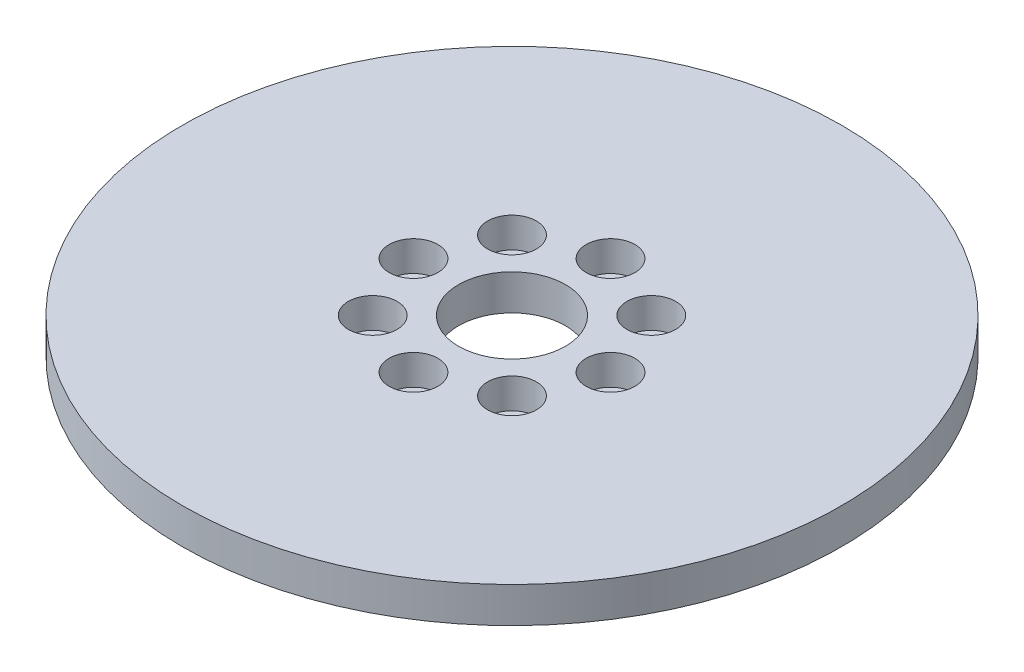
ISO-10303-21;
HEADER;
FILE_DESCRIPTION(('STEP AP214'),'2;1');
FILE_NAME('part.step','',(''),(''),'','','');
FILE_SCHEMA(('AUTOMOTIVE_DESIGN { 1 0 10303 214 1 1 1 1 }'));
ENDSEC;
DATA;
#1=APPLICATION_CONTEXT('core data for automotive mechanical design processes');
#2=APPLICATION_PROTOCOL_DEFINITION('international standard','automotive_design',2000,#1);
#3=PRODUCT_CONTEXT('',#1,'mechanical');
#4=PRODUCT('Part','Part','',(#3));
#5=PRODUCT_RELATED_PRODUCT_CATEGORY('part','',(#4));
#6=PRODUCT_DEFINITION_FORMATION('','',#4);
#7=PRODUCT_DEFINITION_CONTEXT('part definition',#1,'design');
#8=PRODUCT_DEFINITION('design','',#6,#7);
#9=PRODUCT_DEFINITION_SHAPE('','',#8);
#10=(LENGTH_UNIT() NAMED_UNIT(*) SI_UNIT(.MILLI.,.METRE.));
#11=(NAMED_UNIT(*) PLANE_ANGLE_UNIT() SI_UNIT($,.RADIAN.));
#12=(NAMED_UNIT(*) SI_UNIT($,.STERADIAN.) SOLID_ANGLE_UNIT());
#13=UNCERTAINTY_MEASURE_WITH_UNIT(LENGTH_MEASURE(1.E-05),#10,'distance_accuracy_value','');
#14=(GEOMETRIC_REPRESENTATION_CONTEXT(3) GLOBAL_UNCERTAINTY_ASSIGNED_CONTEXT((#13)) GLOBAL_UNIT_ASSIGNED_CONTEXT((#10,
#11,#12)) REPRESENTATION_CONTEXT('',''));
#15=CARTESIAN_POINT('',(0.,0.,0.));
#16=DIRECTION('',(0.,0.,1.));
#17=DIRECTION('',(1.,0.,0.));
#18=AXIS2_PLACEMENT_3D('',#15,#16,#17);
#19=CARTESIAN_POINT('',(0.,10.,0.));
#20=DIRECTION('',(0.,-1.,0.));
#21=DIRECTION('',(0.,0.,-1.));
#22=AXIS2_PLACEMENT_3D('',#19,#20,#21);
#23=CYLINDRICAL_SURFACE('',#22,92.5);
#24=CARTESIAN_POINT('',(0.,10.,0.));
#25=DIRECTION('',(0.,1.,0.));
#26=DIRECTION('',(0.,0.,1.));
#27=AXIS2_PLACEMENT_3D('',#24,#25,#26);
#28=CIRCLE('',#27,92.5);
#29=CARTESIAN_POINT('',(0.,10.,92.5));
#30=VERTEX_POINT('',#29);
#31=EDGE_CURVE('E10',#30,#30,#28,.T.);
#32=ORIENTED_EDGE('',*,*,#31,.F.);
#33=EDGE_LOOP('',(#32));
#34=FACE_BOUND('',#33,.T.);
#35=CARTESIAN_POINT('',(0.,0.,0.));
#36=DIRECTION('',(0.,1.,0.));
#37=DIRECTION('',(0.,0.,1.));
#38=AXIS2_PLACEMENT_3D('',#35,#36,#37);
#39=CIRCLE('',#38,92.5);
#40=CARTESIAN_POINT('',(0.,0.,92.5));
#41=VERTEX_POINT('',#40);
#42=EDGE_CURVE('E37',#41,#41,#39,.T.);
#43=ORIENTED_EDGE('',*,*,#42,.T.);
#44=EDGE_LOOP('',(#43));
#45=FACE_BOUND('',#44,.T.);
#46=ADVANCED_FACE('F40',(#34,#45),#23,.T.);
#47=CARTESIAN_POINT('',(0.,10.,0.));
#48=DIRECTION('',(0.,1.,0.));
#49=DIRECTION('',(0.,0.,1.));
#50=AXIS2_PLACEMENT_3D('',#47,#48,#49);
#51=PLANE('',#50);
#52=CARTESIAN_POINT('',(0.,10.,27.6490217323456));
#53=DIRECTION('',(0.,1.,0.));
#54=DIRECTION('',(1.,0.,0.));
#55=AXIS2_PLACEMENT_3D('',#52,#53,#54);
#56=CIRCLE('',#55,6.83702229934793);
#57=CARTESIAN_POINT('',(6.83702229934802,10.,27.6490217323456));
#58=VERTEX_POINT('',#57);
#59=EDGE_CURVE('E88',#58,#58,#56,.T.);
#60=ORIENTED_EDGE('',*,*,#59,.F.);
#61=EDGE_LOOP('',(#60));
#62=FACE_BOUND('',#61,.T.);
#63=CARTESIAN_POINT('',(19.5508107601159,10.,19.5508107601157));
#64=DIRECTION('',(0.,1.,0.));
#65=DIRECTION('',(0.707106781186544,0.,-0.707106781186551));
#66=AXIS2_PLACEMENT_3D('',#63,#64,#65);
#67=CIRCLE('',#66,6.83702229934793);
#68=CARTESIAN_POINT('',(24.3853155911084,10.,14.7163059291231));
#69=VERTEX_POINT('',#68);
#70=EDGE_CURVE('E79',#69,#69,#67,.T.);
#71=ORIENTED_EDGE('',*,*,#70,.F.);
#72=EDGE_LOOP('',(#71));
#73=FACE_BOUND('',#72,.T.);
#74=CARTESIAN_POINT('',(27.6490217323456,10.,0.));
#75=DIRECTION('',(0.,1.,0.));
#76=DIRECTION('',(0.,0.,-1.));
#77=AXIS2_PLACEMENT_3D('',#74,#75,#76);
#78=CIRCLE('',#77,6.83702229934793);
#79=CARTESIAN_POINT('',(27.6490217323456,10.,-6.83702229934793));
#80=VERTEX_POINT('',#79);
#81=EDGE_CURVE('E74',#80,#80,#78,.T.);
#82=ORIENTED_EDGE('',*,*,#81,.F.);
#83=EDGE_LOOP('',(#82));
#84=FACE_BOUND('',#83,.T.);
#85=CARTESIAN_POINT('',(19.5508107601156,10.,-19.550810760116));
#86=DIRECTION('',(0.,1.,0.));
#87=DIRECTION('',(-0.707106781186554,0.,-0.707106781186541));
#88=AXIS2_PLACEMENT_3D('',#85,#86,#87);
#89=CIRCLE('',#88,6.83702229934793);
#90=CARTESIAN_POINT('',(14.716305929123,10.,-24.3853155911085));
#91=VERTEX_POINT('',#90);
#92=EDGE_CURVE('E70',#91,#91,#89,.T.);
#93=ORIENTED_EDGE('',*,*,#92,.F.);
#94=EDGE_LOOP('',(#93));
#95=FACE_BOUND('',#94,.T.);
#96=CARTESIAN_POINT('',(-2.89608130247259E-13,10.,-27.6490217323456));
#97=DIRECTION('',(0.,1.,0.));
#98=DIRECTION('',(-1.,0.,0.));
#99=AXIS2_PLACEMENT_3D('',#96,#97,#98);
#100=CIRCLE('',#99,6.83702229934793);
#101=CARTESIAN_POINT('',(-6.83702229934822,10.,-27.6490217323455));
#102=VERTEX_POINT('',#101);
#103=EDGE_CURVE('E100',#102,#102,#100,.T.);
#104=ORIENTED_EDGE('',*,*,#103,.F.);
#105=EDGE_LOOP('',(#104));
#106=FACE_BOUND('',#105,.T.);
#107=CARTESIAN_POINT('',(-19.550810760116,10.,-19.5508107601156));
#108=DIRECTION('',(0.,1.,0.));
#109=DIRECTION('',(-0.707106781186539,0.,0.707106781186556));
#110=AXIS2_PLACEMENT_3D('',#107,#108,#109);
#111=CIRCLE('',#110,6.83702229934793);
#112=CARTESIAN_POINT('',(-24.3853155911085,10.,-14.7163059291229));
#113=VERTEX_POINT('',#112);
#114=EDGE_CURVE('E93',#113,#113,#111,.T.);
#115=ORIENTED_EDGE('',*,*,#114,.F.);
#116=EDGE_LOOP('',(#115));
#117=FACE_BOUND('',#116,.T.);
#118=CARTESIAN_POINT('',(-19.5508107601158,10.,19.5508107601158));
#119=DIRECTION('',(0.,1.,0.));
#120=DIRECTION('',(0.707106781186549,0.,0.707106781186546));
#121=AXIS2_PLACEMENT_3D('',#118,#119,#120);
#122=CIRCLE('',#121,6.83702229934793);
#123=CARTESIAN_POINT('',(-14.7163059291232,10.,24.3853155911084));
#124=VERTEX_POINT('',#123);
#125=EDGE_CURVE('E61',#124,#124,#122,.T.);
#126=ORIENTED_EDGE('',*,*,#125,.F.);
#127=EDGE_LOOP('',(#126));
#128=FACE_BOUND('',#127,.T.);
#129=CARTESIAN_POINT('',(-27.6490217323456,10.,0.));
#130=DIRECTION('',(0.,1.,0.));
#131=DIRECTION('',(0.,0.,1.));
#132=AXIS2_PLACEMENT_3D('',#129,#130,#131);
#133=CIRCLE('',#132,6.83702229934793);
#134=CARTESIAN_POINT('',(-27.6490217323456,10.,6.83702229934793));
#135=VERTEX_POINT('',#134);
#136=EDGE_CURVE('E54',#135,#135,#133,.T.);
#137=ORIENTED_EDGE('',*,*,#136,.F.);
#138=EDGE_LOOP('',(#137));
#139=FACE_BOUND('',#138,.T.);
#140=CARTESIAN_POINT('',(0.,10.,0.));
#141=DIRECTION('',(0.,1.,0.));
#142=DIRECTION('',(0.,0.,1.));
#143=AXIS2_PLACEMENT_3D('',#140,#141,#142);
#144=CIRCLE('',#143,15.);
#145=CARTESIAN_POINT('',(0.,10.,15.));
#146=VERTEX_POINT('',#145);
#147=EDGE_CURVE('E50',#146,#146,#144,.T.);
#148=ORIENTED_EDGE('',*,*,#147,.F.);
#149=EDGE_LOOP('',(#148));
#150=FACE_BOUND('',#149,.T.);
#151=ORIENTED_EDGE('',*,*,#31,.T.);
#152=EDGE_LOOP('',(#151));
#153=FACE_BOUND('',#152,.T.);
#154=ADVANCED_FACE('F115',(#62,#73,#84,#95,#106,#117,#128,#139,#150,#153),#51,.T.);
#155=CARTESIAN_POINT('',(0.,0.,0.));
#156=DIRECTION('',(0.,1.,0.));
#157=DIRECTION('',(0.,0.,1.));
#158=AXIS2_PLACEMENT_3D('',#155,#156,#157);
#159=PLANE('',#158);
#160=CARTESIAN_POINT('',(0.,0.,0.));
#161=DIRECTION('',(0.,1.,0.));
#162=DIRECTION('',(0.,0.,1.));
#163=AXIS2_PLACEMENT_3D('',#160,#161,#162);
#164=CIRCLE('',#163,15.);
#165=CARTESIAN_POINT('',(0.,0.,15.));
#166=VERTEX_POINT('',#165);
#167=EDGE_CURVE('E47',#166,#166,#164,.T.);
#168=ORIENTED_EDGE('',*,*,#167,.T.);
#169=EDGE_LOOP('',(#168));
#170=FACE_BOUND('',#169,.T.);
#171=ORIENTED_EDGE('',*,*,#42,.F.);
#172=EDGE_LOOP('',(#171));
#173=FACE_BOUND('',#172,.T.);
#174=ADVANCED_FACE('F113',(#170,#173),#159,.F.);
#175=CARTESIAN_POINT('',(0.,10.,0.));
#176=DIRECTION('',(0.,-1.,0.));
#177=DIRECTION('',(0.,0.,-1.));
#178=AXIS2_PLACEMENT_3D('',#175,#176,#177);
#179=CYLINDRICAL_SURFACE('',#178,15.);
#180=ORIENTED_EDGE('',*,*,#147,.T.);
#181=EDGE_LOOP('',(#180));
#182=FACE_BOUND('',#181,.T.);
#183=ORIENTED_EDGE('',*,*,#167,.F.);
#184=EDGE_LOOP('',(#183));
#185=FACE_BOUND('',#184,.T.);
#186=ADVANCED_FACE('F127',(#182,#185),#179,.F.);
#187=CARTESIAN_POINT('',(-27.6490217323456,1.53303863989776,0.));
#188=DIRECTION('',(0.,1.,0.));
#189=DIRECTION('',(0.,0.,1.));
#190=AXIS2_PLACEMENT_3D('',#187,#188,#189);
#191=CYLINDRICAL_SURFACE('',#190,6.83702229934793);
#192=CARTESIAN_POINT('',(-27.6490217323456,1.53303863989776,0.));
#193=DIRECTION('',(0.,1.,0.));
#194=DIRECTION('',(0.,0.,1.));
#195=AXIS2_PLACEMENT_3D('',#192,#193,#194);
#196=CIRCLE('',#195,6.83702229934793);
#197=CARTESIAN_POINT('',(-27.6490217323456,1.53303863989776,6.83702229934793));
#198=VERTEX_POINT('',#197);
#199=EDGE_CURVE('E55',#198,#198,#196,.T.);
#200=ORIENTED_EDGE('',*,*,#199,.F.);
#201=EDGE_LOOP('',(#200));
#202=FACE_BOUND('',#201,.T.);
#203=ORIENTED_EDGE('',*,*,#136,.T.);
#204=EDGE_LOOP('',(#203));
#205=FACE_BOUND('',#204,.T.);
#206=ADVANCED_FACE('F129',(#202,#205),#191,.F.);
#207=CARTESIAN_POINT('',(-27.6490217323456,1.53303863989776,0.));
#208=DIRECTION('',(0.,1.,0.));
#209=DIRECTION('',(0.,0.,1.));
#210=AXIS2_PLACEMENT_3D('',#207,#208,#209);
#211=PLANE('',#210);
#212=ORIENTED_EDGE('',*,*,#199,.T.);
#213=EDGE_LOOP('',(#212));
#214=FACE_BOUND('',#213,.T.);
#215=ADVANCED_FACE('F157',(#214),#211,.T.);
#216=CARTESIAN_POINT('',(-19.5508107601158,1.53303863989776,19.5508107601158));
#217=DIRECTION('',(0.,1.,0.));
#218=DIRECTION('',(0.,0.,1.));
#219=AXIS2_PLACEMENT_3D('',#216,#217,#218);
#220=CYLINDRICAL_SURFACE('',#219,6.83702229934793);
#221=CARTESIAN_POINT('',(-19.5508107601158,1.53303863989776,19.5508107601158));
#222=DIRECTION('',(0.,1.,0.));
#223=DIRECTION('',(0.707106781186549,0.,0.707106781186546));
#224=AXIS2_PLACEMENT_3D('',#221,#222,#223);
#225=CIRCLE('',#224,6.83702229934793);
#226=CARTESIAN_POINT('',(-14.7163059291232,1.53303863989776,24.3853155911084));
#227=VERTEX_POINT('',#226);
#228=EDGE_CURVE('E59',#227,#227,#225,.T.);
#229=ORIENTED_EDGE('',*,*,#228,.F.);
#230=EDGE_LOOP('',(#229));
#231=FACE_BOUND('',#230,.T.);
#232=ORIENTED_EDGE('',*,*,#125,.T.);
#233=EDGE_LOOP('',(#232));
#234=FACE_BOUND('',#233,.T.);
#235=ADVANCED_FACE('F170',(#231,#234),#220,.F.);
#236=CARTESIAN_POINT('',(-19.5508107601158,1.53303863989776,19.5508107601158));
#237=DIRECTION('',(0.,1.,0.));
#238=DIRECTION('',(0.707106781186549,0.,0.707106781186546));
#239=AXIS2_PLACEMENT_3D('',#236,#237,#238);
#240=PLANE('',#239);
#241=ORIENTED_EDGE('',*,*,#228,.T.);
#242=EDGE_LOOP('',(#241));
#243=FACE_BOUND('',#242,.T.);
#244=ADVANCED_FACE('F182',(#243),#240,.T.);
#245=CARTESIAN_POINT('',(-19.550810760116,1.53303863989776,-19.5508107601156));
#246=DIRECTION('',(0.,1.,0.));
#247=DIRECTION('',(0.,0.,1.));
#248=AXIS2_PLACEMENT_3D('',#245,#246,#247);
#249=CYLINDRICAL_SURFACE('',#248,6.83702229934793);
#250=CARTESIAN_POINT('',(-19.550810760116,1.53303863989776,-19.5508107601156));
#251=DIRECTION('',(0.,1.,0.));
#252=DIRECTION('',(-0.707106781186539,0.,0.707106781186556));
#253=AXIS2_PLACEMENT_3D('',#250,#251,#252);
#254=CIRCLE('',#253,6.83702229934793);
#255=CARTESIAN_POINT('',(-24.3853155911085,1.53303863989776,-14.7163059291229));
#256=VERTEX_POINT('',#255);
#257=EDGE_CURVE('E94',#256,#256,#254,.T.);
#258=ORIENTED_EDGE('',*,*,#257,.F.);
#259=EDGE_LOOP('',(#258));
#260=FACE_BOUND('',#259,.T.);
#261=ORIENTED_EDGE('',*,*,#114,.T.);
#262=EDGE_LOOP('',(#261));
#263=FACE_BOUND('',#262,.T.);
#264=ADVANCED_FACE('F189',(#260,#263),#249,.F.);
#265=CARTESIAN_POINT('',(-19.550810760116,1.53303863989776,-19.5508107601156));
#266=DIRECTION('',(0.,1.,0.));
#267=DIRECTION('',(-0.707106781186539,0.,0.707106781186556));
#268=AXIS2_PLACEMENT_3D('',#265,#266,#267);
#269=PLANE('',#268);
#270=ORIENTED_EDGE('',*,*,#257,.T.);
#271=EDGE_LOOP('',(#270));
#272=FACE_BOUND('',#271,.T.);
#273=ADVANCED_FACE('F107',(#272),#269,.T.);
#274=CARTESIAN_POINT('',(-2.89608130247259E-13,1.53303863989776,-27.6490217323456));
#275=DIRECTION('',(0.,1.,0.));
#276=DIRECTION('',(0.,0.,1.));
#277=AXIS2_PLACEMENT_3D('',#274,#275,#276);
#278=CYLINDRICAL_SURFACE('',#277,6.83702229934793);
#279=CARTESIAN_POINT('',(-2.89608130247259E-13,1.53303863989776,-27.6490217323456));
#280=DIRECTION('',(0.,1.,0.));
#281=DIRECTION('',(-1.,0.,0.));
#282=AXIS2_PLACEMENT_3D('',#279,#280,#281);
#283=CIRCLE('',#282,6.83702229934793);
#284=CARTESIAN_POINT('',(-6.83702229934822,1.53303863989776,-27.6490217323455));
#285=VERTEX_POINT('',#284);
#286=EDGE_CURVE('E72',#285,#285,#283,.T.);
#287=ORIENTED_EDGE('',*,*,#286,.F.);
#288=EDGE_LOOP('',(#287));
#289=FACE_BOUND('',#288,.T.);
#290=ORIENTED_EDGE('',*,*,#103,.T.);
#291=EDGE_LOOP('',(#290));
#292=FACE_BOUND('',#291,.T.);
#293=ADVANCED_FACE('F104',(#289,#292),#278,.F.);
#294=CARTESIAN_POINT('',(-2.89608130247259E-13,1.53303863989776,-27.6490217323456));
#295=DIRECTION('',(0.,1.,0.));
#296=DIRECTION('',(-1.,0.,0.));
#297=AXIS2_PLACEMENT_3D('',#294,#295,#296);
#298=PLANE('',#297);
#299=ORIENTED_EDGE('',*,*,#286,.T.);
#300=EDGE_LOOP('',(#299));
#301=FACE_BOUND('',#300,.T.);
#302=ADVANCED_FACE('F103',(#301),#298,.T.);
#303=CARTESIAN_POINT('',(19.5508107601156,1.53303863989776,-19.550810760116));
#304=DIRECTION('',(0.,1.,0.));
#305=DIRECTION('',(0.,0.,1.));
#306=AXIS2_PLACEMENT_3D('',#303,#304,#305);
#307=CYLINDRICAL_SURFACE('',#306,6.83702229934793);
#308=CARTESIAN_POINT('',(19.5508107601156,1.53303863989776,-19.550810760116));
#309=DIRECTION('',(0.,1.,0.));
#310=DIRECTION('',(-0.707106781186554,0.,-0.707106781186541));
#311=AXIS2_PLACEMENT_3D('',#308,#309,#310);
#312=CIRCLE('',#311,6.83702229934793);
#313=CARTESIAN_POINT('',(14.716305929123,1.53303863989776,-24.3853155911085));
#314=VERTEX_POINT('',#313);
#315=EDGE_CURVE('E69',#314,#314,#312,.T.);
#316=ORIENTED_EDGE('',*,*,#315,.F.);
#317=EDGE_LOOP('',(#316));
#318=FACE_BOUND('',#317,.T.);
#319=ORIENTED_EDGE('',*,*,#92,.T.);
#320=EDGE_LOOP('',(#319));
#321=FACE_BOUND('',#320,.T.);
#322=ADVANCED_FACE('F219',(#318,#321),#307,.F.);
#323=CARTESIAN_POINT('',(19.5508107601156,1.53303863989776,-19.550810760116));
#324=DIRECTION('',(0.,1.,0.));
#325=DIRECTION('',(-0.707106781186554,0.,-0.707106781186541));
#326=AXIS2_PLACEMENT_3D('',#323,#324,#325);
#327=PLANE('',#326);
#328=ORIENTED_EDGE('',*,*,#315,.T.);
#329=EDGE_LOOP('',(#328));
#330=FACE_BOUND('',#329,.T.);
#331=ADVANCED_FACE('F227',(#330),#327,.T.);
#332=CARTESIAN_POINT('',(27.6490217323456,1.53303863989776,0.));
#333=DIRECTION('',(0.,1.,0.));
#334=DIRECTION('',(0.,0.,1.));
#335=AXIS2_PLACEMENT_3D('',#332,#333,#334);
#336=CYLINDRICAL_SURFACE('',#335,6.83702229934793);
#337=CARTESIAN_POINT('',(27.6490217323456,1.53303863989776,0.));
#338=DIRECTION('',(0.,1.,0.));
#339=DIRECTION('',(0.,0.,-1.));
#340=AXIS2_PLACEMENT_3D('',#337,#338,#339);
#341=CIRCLE('',#340,6.83702229934793);
#342=CARTESIAN_POINT('',(27.6490217323456,1.53303863989776,-6.83702229934793));
#343=VERTEX_POINT('',#342);
#344=EDGE_CURVE('E80',#343,#343,#341,.T.);
#345=ORIENTED_EDGE('',*,*,#344,.F.);
#346=EDGE_LOOP('',(#345));
#347=FACE_BOUND('',#346,.T.);
#348=ORIENTED_EDGE('',*,*,#81,.T.);
#349=EDGE_LOOP('',(#348));
#350=FACE_BOUND('',#349,.T.);
#351=ADVANCED_FACE('F240',(#347,#350),#336,.F.);
#352=CARTESIAN_POINT('',(27.6490217323456,1.53303863989776,0.));
#353=DIRECTION('',(0.,1.,0.));
#354=DIRECTION('',(0.,0.,-1.));
#355=AXIS2_PLACEMENT_3D('',#352,#353,#354);
#356=PLANE('',#355);
#357=ORIENTED_EDGE('',*,*,#344,.T.);
#358=EDGE_LOOP('',(#357));
#359=FACE_BOUND('',#358,.T.);
#360=ADVANCED_FACE('F246',(#359),#356,.T.);
#361=CARTESIAN_POINT('',(19.5508107601159,1.53303863989776,19.5508107601157));
#362=DIRECTION('',(0.,1.,0.));
#363=DIRECTION('',(0.,0.,1.));
#364=AXIS2_PLACEMENT_3D('',#361,#362,#363);
#365=CYLINDRICAL_SURFACE('',#364,6.83702229934793);
#366=CARTESIAN_POINT('',(19.5508107601159,1.53303863989776,19.5508107601157));
#367=DIRECTION('',(0.,1.,0.));
#368=DIRECTION('',(0.707106781186544,0.,-0.707106781186551));
#369=AXIS2_PLACEMENT_3D('',#366,#367,#368);
#370=CIRCLE('',#369,6.83702229934793);
#371=CARTESIAN_POINT('',(24.3853155911084,1.53303863989776,14.7163059291231));
#372=VERTEX_POINT('',#371);
#373=EDGE_CURVE('E82',#372,#372,#370,.T.);
#374=ORIENTED_EDGE('',*,*,#373,.F.);
#375=EDGE_LOOP('',(#374));
#376=FACE_BOUND('',#375,.T.);
#377=ORIENTED_EDGE('',*,*,#70,.T.);
#378=EDGE_LOOP('',(#377));
#379=FACE_BOUND('',#378,.T.);
#380=ADVANCED_FACE('F254',(#376,#379),#365,.F.);
#381=CARTESIAN_POINT('',(19.5508107601159,1.53303863989776,19.5508107601157));
#382=DIRECTION('',(0.,1.,0.));
#383=DIRECTION('',(0.707106781186544,0.,-0.707106781186551));
#384=AXIS2_PLACEMENT_3D('',#381,#382,#383);
#385=PLANE('',#384);
#386=ORIENTED_EDGE('',*,*,#373,.T.);
#387=EDGE_LOOP('',(#386));
#388=FACE_BOUND('',#387,.T.);
#389=ADVANCED_FACE('F262',(#388),#385,.T.);
#390=CARTESIAN_POINT('',(0.,1.53303863989776,27.6490217323456));
#391=DIRECTION('',(0.,1.,0.));
#392=DIRECTION('',(0.,0.,1.));
#393=AXIS2_PLACEMENT_3D('',#390,#391,#392);
#394=CYLINDRICAL_SURFACE('',#393,6.83702229934793);
#395=CARTESIAN_POINT('',(0.,1.53303863989776,27.6490217323456));
#396=DIRECTION('',(0.,1.,0.));
#397=DIRECTION('',(1.,0.,0.));
#398=AXIS2_PLACEMENT_3D('',#395,#396,#397);
#399=CIRCLE('',#398,6.83702229934793);
#400=CARTESIAN_POINT('',(6.83702229934802,1.53303863989776,27.6490217323456));
#401=VERTEX_POINT('',#400);
#402=EDGE_CURVE('E63',#401,#401,#399,.T.);
#403=ORIENTED_EDGE('',*,*,#402,.F.);
#404=EDGE_LOOP('',(#403));
#405=FACE_BOUND('',#404,.T.);
#406=ORIENTED_EDGE('',*,*,#59,.T.);
#407=EDGE_LOOP('',(#406));
#408=FACE_BOUND('',#407,.T.);
#409=ADVANCED_FACE('F272',(#405,#408),#394,.F.);
#410=CARTESIAN_POINT('',(0.,1.53303863989776,27.6490217323456));
#411=DIRECTION('',(0.,1.,0.));
#412=DIRECTION('',(1.,0.,0.));
#413=AXIS2_PLACEMENT_3D('',#410,#411,#412);
#414=PLANE('',#413);
#415=ORIENTED_EDGE('',*,*,#402,.T.);
#416=EDGE_LOOP('',(#415));
#417=FACE_BOUND('',#416,.T.);
#418=ADVANCED_FACE('F285',(#417),#414,.T.);
#419=CLOSED_SHELL('',(#46,#154,#174,#186,#206,#215,#235,#244,#264,#273,#293,#302,#322,#331,#351,
#360,#380,#389,#409,#418));
#420=MANIFOLD_SOLID_BREP('B2',#419);
#421=ADVANCED_BREP_SHAPE_REPRESENTATION('',(#18,#420),#14);
#422=SHAPE_DEFINITION_REPRESENTATION(#9,#421);
ENDSEC;
END-ISO-10303-21;
